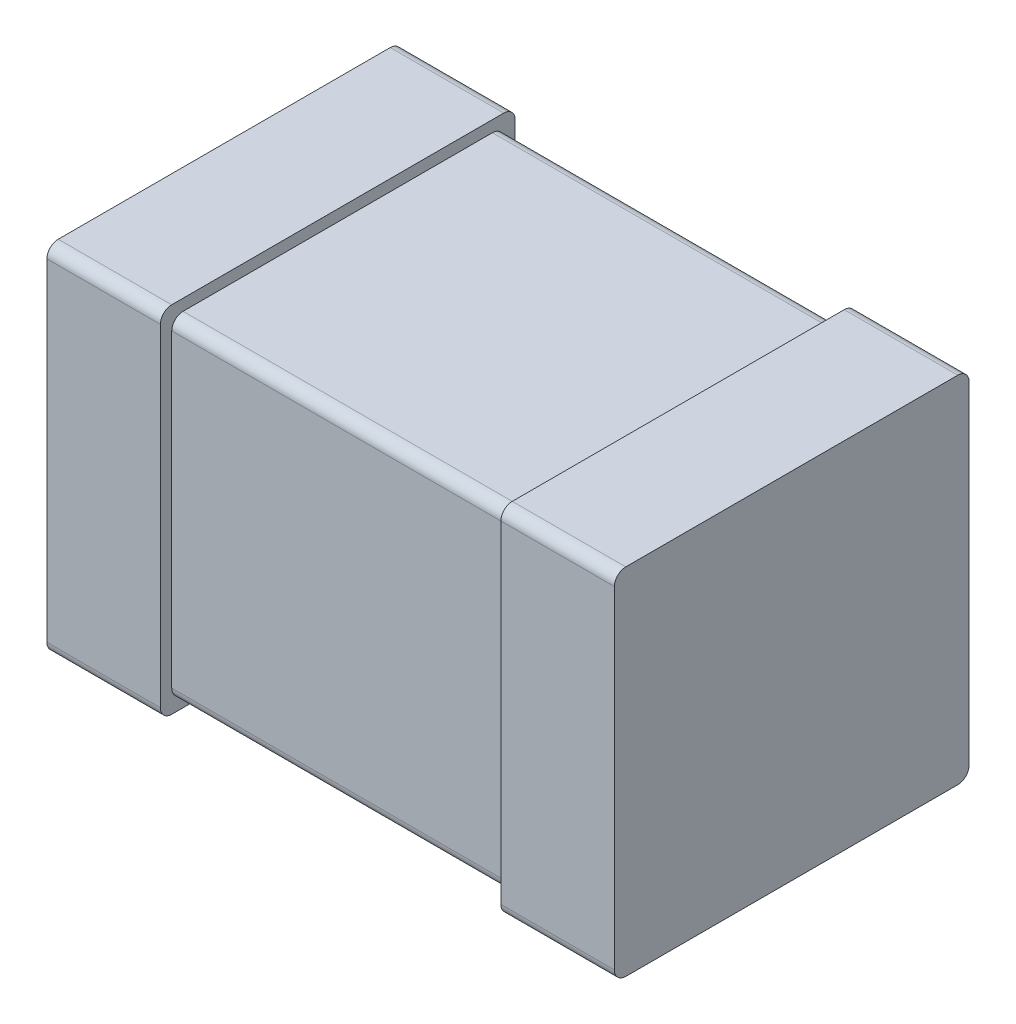
ISO-10303-21;
HEADER;
FILE_DESCRIPTION(('STEP AP214'),'2;1');
FILE_NAME('part.step','',(''),(''),'','','');
FILE_SCHEMA(('AUTOMOTIVE_DESIGN { 1 0 10303 214 1 1 1 1 }'));
ENDSEC;
DATA;
#1=APPLICATION_CONTEXT('core data for automotive mechanical design processes');
#2=APPLICATION_PROTOCOL_DEFINITION('international standard','automotive_design',2000,#1);
#3=PRODUCT_CONTEXT('',#1,'mechanical');
#4=PRODUCT('Part','Part','',(#3));
#5=PRODUCT_RELATED_PRODUCT_CATEGORY('part','',(#4));
#6=PRODUCT_DEFINITION_FORMATION('','',#4);
#7=PRODUCT_DEFINITION_CONTEXT('part definition',#1,'design');
#8=PRODUCT_DEFINITION('design','',#6,#7);
#9=PRODUCT_DEFINITION_SHAPE('','',#8);
#10=(LENGTH_UNIT() NAMED_UNIT(*) SI_UNIT(.MILLI.,.METRE.));
#11=(NAMED_UNIT(*) PLANE_ANGLE_UNIT() SI_UNIT($,.RADIAN.));
#12=(NAMED_UNIT(*) SI_UNIT($,.STERADIAN.) SOLID_ANGLE_UNIT());
#13=UNCERTAINTY_MEASURE_WITH_UNIT(LENGTH_MEASURE(1.E-05),#10,'distance_accuracy_value','');
#14=(GEOMETRIC_REPRESENTATION_CONTEXT(3) GLOBAL_UNCERTAINTY_ASSIGNED_CONTEXT((#13)) GLOBAL_UNIT_ASSIGNED_CONTEXT((#10,
#11,#12)) REPRESENTATION_CONTEXT('',''));
#15=CARTESIAN_POINT('',(0.,0.,0.));
#16=DIRECTION('',(0.,0.,1.));
#17=DIRECTION('',(1.,0.,0.));
#18=AXIS2_PLACEMENT_3D('',#15,#16,#17);
#19=CARTESIAN_POINT('',(-1.,-0.625,0.));
#20=DIRECTION('',(1.,0.,0.));
#21=DIRECTION('',(0.,1.,0.));
#22=AXIS2_PLACEMENT_3D('',#19,#20,#21);
#23=PLANE('',#22);
#24=CARTESIAN_POINT('',(-1.,-0.585,1.21));
#25=DIRECTION('',(-1.,0.,0.));
#26=DIRECTION('',(0.,0.,1.));
#27=AXIS2_PLACEMENT_3D('',#24,#25,#26);
#28=CIRCLE('',#27,0.04);
#29=CARTESIAN_POINT('',(-1.,-0.625,1.21));
#30=VERTEX_POINT('',#29);
#31=CARTESIAN_POINT('',(-1.,-0.585,1.25));
#32=VERTEX_POINT('',#31);
#33=EDGE_CURVE('E11',#30,#32,#28,.T.);
#34=ORIENTED_EDGE('',*,*,#33,.T.);
#35=DIRECTION('',(0.,1.,0.));
#36=VECTOR('',#35,1.);
#37=CARTESIAN_POINT('',(-1.,-0.625,1.25));
#38=LINE('',#37,#36);
#39=CARTESIAN_POINT('',(-1.,0.585,1.25));
#40=VERTEX_POINT('',#39);
#41=EDGE_CURVE('E27',#32,#40,#38,.T.);
#42=ORIENTED_EDGE('',*,*,#41,.T.);
#43=CARTESIAN_POINT('',(-1.,0.585,1.21));
#44=DIRECTION('',(1.,0.,0.));
#45=DIRECTION('',(0.,0.,1.));
#46=AXIS2_PLACEMENT_3D('',#43,#44,#45);
#47=CIRCLE('',#46,0.04);
#48=CARTESIAN_POINT('',(-1.,0.625,1.21));
#49=VERTEX_POINT('',#48);
#50=EDGE_CURVE('E466',#49,#40,#47,.T.);
#51=ORIENTED_EDGE('',*,*,#50,.F.);
#52=DIRECTION('',(0.,0.,1.));
#53=VECTOR('',#52,1.);
#54=CARTESIAN_POINT('',(-1.,0.625,0.));
#55=LINE('',#54,#53);
#56=CARTESIAN_POINT('',(-1.,0.625,0.04));
#57=VERTEX_POINT('',#56);
#58=EDGE_CURVE('E264',#57,#49,#55,.T.);
#59=ORIENTED_EDGE('',*,*,#58,.F.);
#60=CARTESIAN_POINT('',(-1.,0.585,0.04));
#61=DIRECTION('',(-1.,0.,0.));
#62=DIRECTION('',(0.,0.,1.));
#63=AXIS2_PLACEMENT_3D('',#60,#61,#62);
#64=CIRCLE('',#63,0.04);
#65=CARTESIAN_POINT('',(-1.,0.585,0.));
#66=VERTEX_POINT('',#65);
#67=EDGE_CURVE('E342',#57,#66,#64,.T.);
#68=ORIENTED_EDGE('',*,*,#67,.T.);
#69=DIRECTION('',(0.,1.,0.));
#70=VECTOR('',#69,1.);
#71=CARTESIAN_POINT('',(-1.,-0.625,0.));
#72=LINE('',#71,#70);
#73=CARTESIAN_POINT('',(-1.,-0.585,0.));
#74=VERTEX_POINT('',#73);
#75=EDGE_CURVE('E278',#74,#66,#72,.T.);
#76=ORIENTED_EDGE('',*,*,#75,.F.);
#77=CARTESIAN_POINT('',(-1.,-0.585,0.04));
#78=DIRECTION('',(1.,0.,0.));
#79=DIRECTION('',(0.,0.,1.));
#80=AXIS2_PLACEMENT_3D('',#77,#78,#79);
#81=CIRCLE('',#80,0.04);
#82=CARTESIAN_POINT('',(-1.,-0.625,0.04));
#83=VERTEX_POINT('',#82);
#84=EDGE_CURVE('E358',#83,#74,#81,.T.);
#85=ORIENTED_EDGE('',*,*,#84,.F.);
#86=DIRECTION('',(0.,0.,1.));
#87=VECTOR('',#86,1.);
#88=CARTESIAN_POINT('',(-1.,-0.625,0.));
#89=LINE('',#88,#87);
#90=EDGE_CURVE('E346',#83,#30,#89,.T.);
#91=ORIENTED_EDGE('',*,*,#90,.T.);
#92=EDGE_LOOP('',(#34,#42,#51,#59,#68,#76,#85,#91));
#93=FACE_BOUND('',#92,.T.);
#94=ADVANCED_FACE('F16',(#93),#23,.F.);
#95=CARTESIAN_POINT('',(-1.,-0.625,0.));
#96=DIRECTION('',(0.,1.,0.));
#97=DIRECTION('',(1.,0.,0.));
#98=AXIS2_PLACEMENT_3D('',#95,#96,#97);
#99=PLANE('',#98);
#100=DIRECTION('',(1.,0.,0.));
#101=VECTOR('',#100,1.);
#102=CARTESIAN_POINT('',(-1.,-0.625,1.21));
#103=LINE('',#102,#101);
#104=CARTESIAN_POINT('',(-0.6,-0.625,1.21));
#105=VERTEX_POINT('',#104);
#106=EDGE_CURVE('E336',#30,#105,#103,.T.);
#107=ORIENTED_EDGE('',*,*,#106,.F.);
#108=ORIENTED_EDGE('',*,*,#90,.F.);
#109=DIRECTION('',(1.,0.,0.));
#110=VECTOR('',#109,1.);
#111=CARTESIAN_POINT('',(-1.,-0.625,0.04));
#112=LINE('',#111,#110);
#113=CARTESIAN_POINT('',(-0.6,-0.625,0.04));
#114=VERTEX_POINT('',#113);
#115=EDGE_CURVE('E353',#83,#114,#112,.T.);
#116=ORIENTED_EDGE('',*,*,#115,.T.);
#117=DIRECTION('',(0.,0.,1.));
#118=VECTOR('',#117,1.);
#119=CARTESIAN_POINT('',(-0.6,-0.625,0.));
#120=LINE('',#119,#118);
#121=EDGE_CURVE('E354',#114,#105,#120,.T.);
#122=ORIENTED_EDGE('',*,*,#121,.T.);
#123=EDGE_LOOP('',(#107,#108,#116,#122));
#124=FACE_BOUND('',#123,.T.);
#125=ADVANCED_FACE('F572',(#124),#99,.F.);
#126=CARTESIAN_POINT('',(-1.,-0.585,0.04));
#127=DIRECTION('',(1.,0.,0.));
#128=DIRECTION('',(0.,-1.,0.));
#129=AXIS2_PLACEMENT_3D('',#126,#127,#128);
#130=CYLINDRICAL_SURFACE('',#129,0.04);
#131=ORIENTED_EDGE('',*,*,#84,.T.);
#132=DIRECTION('',(1.,0.,0.));
#133=VECTOR('',#132,1.);
#134=CARTESIAN_POINT('',(-1.,-0.585,0.));
#135=LINE('',#134,#133);
#136=CARTESIAN_POINT('',(-0.6,-0.585,0.));
#137=VERTEX_POINT('',#136);
#138=EDGE_CURVE('E435',#74,#137,#135,.T.);
#139=ORIENTED_EDGE('',*,*,#138,.T.);
#140=CARTESIAN_POINT('',(-0.6,-0.585,0.04));
#141=DIRECTION('',(1.,0.,0.));
#142=DIRECTION('',(0.,0.,1.));
#143=AXIS2_PLACEMENT_3D('',#140,#141,#142);
#144=CIRCLE('',#143,0.04);
#145=EDGE_CURVE('E288',#114,#137,#144,.T.);
#146=ORIENTED_EDGE('',*,*,#145,.F.);
#147=ORIENTED_EDGE('',*,*,#115,.F.);
#148=EDGE_LOOP('',(#131,#139,#146,#147));
#149=FACE_BOUND('',#148,.T.);
#150=ADVANCED_FACE('F579',(#149),#130,.T.);
#151=CARTESIAN_POINT('',(-1.,-0.585,1.21));
#152=DIRECTION('',(1.,0.,0.));
#153=DIRECTION('',(0.,-1.,0.));
#154=AXIS2_PLACEMENT_3D('',#151,#152,#153);
#155=CYLINDRICAL_SURFACE('',#154,0.04);
#156=ORIENTED_EDGE('',*,*,#106,.T.);
#157=CARTESIAN_POINT('',(-0.6,-0.585,1.21));
#158=DIRECTION('',(-1.,0.,0.));
#159=DIRECTION('',(0.,0.,1.));
#160=AXIS2_PLACEMENT_3D('',#157,#158,#159);
#161=CIRCLE('',#160,0.04);
#162=CARTESIAN_POINT('',(-0.6,-0.585,1.25));
#163=VERTEX_POINT('',#162);
#164=EDGE_CURVE('E332',#105,#163,#161,.T.);
#165=ORIENTED_EDGE('',*,*,#164,.T.);
#166=DIRECTION('',(1.,0.,0.));
#167=VECTOR('',#166,1.);
#168=CARTESIAN_POINT('',(-1.,-0.585,1.25));
#169=LINE('',#168,#167);
#170=EDGE_CURVE('E275',#32,#163,#169,.T.);
#171=ORIENTED_EDGE('',*,*,#170,.F.);
#172=ORIENTED_EDGE('',*,*,#33,.F.);
#173=EDGE_LOOP('',(#156,#165,#171,#172));
#174=FACE_BOUND('',#173,.T.);
#175=ADVANCED_FACE('F595',(#174),#155,.T.);
#176=CARTESIAN_POINT('',(-1.,-0.625,0.));
#177=DIRECTION('',(0.,0.,1.));
#178=DIRECTION('',(1.,0.,0.));
#179=AXIS2_PLACEMENT_3D('',#176,#177,#178);
#180=PLANE('',#179);
#181=DIRECTION('',(1.,0.,0.));
#182=VECTOR('',#181,1.);
#183=CARTESIAN_POINT('',(-1.,0.585,0.));
#184=LINE('',#183,#182);
#185=CARTESIAN_POINT('',(-0.6,0.585,0.));
#186=VERTEX_POINT('',#185);
#187=EDGE_CURVE('E337',#66,#186,#184,.T.);
#188=ORIENTED_EDGE('',*,*,#187,.T.);
#189=DIRECTION('',(0.,1.,0.));
#190=VECTOR('',#189,1.);
#191=CARTESIAN_POINT('',(-0.6,-0.625,0.));
#192=LINE('',#191,#190);
#193=EDGE_CURVE('E291',#137,#186,#192,.T.);
#194=ORIENTED_EDGE('',*,*,#193,.F.);
#195=ORIENTED_EDGE('',*,*,#138,.F.);
#196=ORIENTED_EDGE('',*,*,#75,.T.);
#197=EDGE_LOOP('',(#188,#194,#195,#196));
#198=FACE_BOUND('',#197,.T.);
#199=ADVANCED_FACE('F18',(#198),#180,.F.);
#200=CARTESIAN_POINT('',(-1.,-0.625,1.25));
#201=DIRECTION('',(0.,0.,1.));
#202=DIRECTION('',(1.,0.,0.));
#203=AXIS2_PLACEMENT_3D('',#200,#201,#202);
#204=PLANE('',#203);
#205=ORIENTED_EDGE('',*,*,#41,.F.);
#206=ORIENTED_EDGE('',*,*,#170,.T.);
#207=DIRECTION('',(0.,1.,0.));
#208=VECTOR('',#207,1.);
#209=CARTESIAN_POINT('',(-0.6,-0.625,1.25));
#210=LINE('',#209,#208);
#211=CARTESIAN_POINT('',(-0.6,0.585,1.25));
#212=VERTEX_POINT('',#211);
#213=EDGE_CURVE('E279',#163,#212,#210,.T.);
#214=ORIENTED_EDGE('',*,*,#213,.T.);
#215=DIRECTION('',(1.,0.,0.));
#216=VECTOR('',#215,1.);
#217=CARTESIAN_POINT('',(-1.,0.585,1.25));
#218=LINE('',#217,#216);
#219=EDGE_CURVE('E267',#40,#212,#218,.T.);
#220=ORIENTED_EDGE('',*,*,#219,.F.);
#221=EDGE_LOOP('',(#205,#206,#214,#220));
#222=FACE_BOUND('',#221,.T.);
#223=ADVANCED_FACE('F638',(#222),#204,.T.);
#224=CARTESIAN_POINT('',(-1.,0.585,0.04));
#225=DIRECTION('',(1.,0.,0.));
#226=DIRECTION('',(0.,1.,0.));
#227=AXIS2_PLACEMENT_3D('',#224,#225,#226);
#228=CYLINDRICAL_SURFACE('',#227,0.04);
#229=DIRECTION('',(1.,0.,0.));
#230=VECTOR('',#229,1.);
#231=CARTESIAN_POINT('',(-1.,0.625,0.04));
#232=LINE('',#231,#230);
#233=CARTESIAN_POINT('',(-0.6,0.625,0.04));
#234=VERTEX_POINT('',#233);
#235=EDGE_CURVE('E393',#57,#234,#232,.T.);
#236=ORIENTED_EDGE('',*,*,#235,.T.);
#237=CARTESIAN_POINT('',(-0.6,0.585,0.04));
#238=DIRECTION('',(-1.,0.,0.));
#239=DIRECTION('',(0.,0.,1.));
#240=AXIS2_PLACEMENT_3D('',#237,#238,#239);
#241=CIRCLE('',#240,0.04);
#242=EDGE_CURVE('E237',#234,#186,#241,.T.);
#243=ORIENTED_EDGE('',*,*,#242,.T.);
#244=ORIENTED_EDGE('',*,*,#187,.F.);
#245=ORIENTED_EDGE('',*,*,#67,.F.);
#246=EDGE_LOOP('',(#236,#243,#244,#245));
#247=FACE_BOUND('',#246,.T.);
#248=ADVANCED_FACE('F640',(#247),#228,.T.);
#249=CARTESIAN_POINT('',(-1.,0.585,1.21));
#250=DIRECTION('',(1.,0.,0.));
#251=DIRECTION('',(0.,1.,0.));
#252=AXIS2_PLACEMENT_3D('',#249,#250,#251);
#253=CYLINDRICAL_SURFACE('',#252,0.04);
#254=ORIENTED_EDGE('',*,*,#50,.T.);
#255=ORIENTED_EDGE('',*,*,#219,.T.);
#256=CARTESIAN_POINT('',(-0.6,0.585,1.21));
#257=DIRECTION('',(1.,0.,0.));
#258=DIRECTION('',(0.,0.,1.));
#259=AXIS2_PLACEMENT_3D('',#256,#257,#258);
#260=CIRCLE('',#259,0.04);
#261=CARTESIAN_POINT('',(-0.6,0.625,1.21));
#262=VERTEX_POINT('',#261);
#263=EDGE_CURVE('E269',#262,#212,#260,.T.);
#264=ORIENTED_EDGE('',*,*,#263,.F.);
#265=DIRECTION('',(1.,0.,0.));
#266=VECTOR('',#265,1.);
#267=CARTESIAN_POINT('',(-1.,0.625,1.21));
#268=LINE('',#267,#266);
#269=EDGE_CURVE('E268',#49,#262,#268,.T.);
#270=ORIENTED_EDGE('',*,*,#269,.F.);
#271=EDGE_LOOP('',(#254,#255,#264,#270));
#272=FACE_BOUND('',#271,.T.);
#273=ADVANCED_FACE('F627',(#272),#253,.T.);
#274=CARTESIAN_POINT('',(-1.,0.625,0.));
#275=DIRECTION('',(0.,1.,0.));
#276=DIRECTION('',(1.,0.,0.));
#277=AXIS2_PLACEMENT_3D('',#274,#275,#276);
#278=PLANE('',#277);
#279=DIRECTION('',(0.,0.,1.));
#280=VECTOR('',#279,1.);
#281=CARTESIAN_POINT('',(-0.6,0.625,0.));
#282=LINE('',#281,#280);
#283=EDGE_CURVE('E273',#234,#262,#282,.T.);
#284=ORIENTED_EDGE('',*,*,#283,.F.);
#285=ORIENTED_EDGE('',*,*,#235,.F.);
#286=ORIENTED_EDGE('',*,*,#58,.T.);
#287=ORIENTED_EDGE('',*,*,#269,.T.);
#288=EDGE_LOOP('',(#284,#285,#286,#287));
#289=FACE_BOUND('',#288,.T.);
#290=ADVANCED_FACE('F607',(#289),#278,.T.);
#291=CARTESIAN_POINT('',(-0.6,-0.625,0.));
#292=DIRECTION('',(1.,0.,0.));
#293=DIRECTION('',(0.,1.,0.));
#294=AXIS2_PLACEMENT_3D('',#291,#292,#293);
#295=PLANE('',#294);
#296=ORIENTED_EDGE('',*,*,#121,.F.);
#297=ORIENTED_EDGE('',*,*,#145,.T.);
#298=ORIENTED_EDGE('',*,*,#193,.T.);
#299=ORIENTED_EDGE('',*,*,#242,.F.);
#300=ORIENTED_EDGE('',*,*,#283,.T.);
#301=ORIENTED_EDGE('',*,*,#263,.T.);
#302=ORIENTED_EDGE('',*,*,#213,.F.);
#303=ORIENTED_EDGE('',*,*,#164,.F.);
#304=EDGE_LOOP('',(#296,#297,#298,#299,#300,#301,#302,#303));
#305=FACE_BOUND('',#304,.T.);
#306=CARTESIAN_POINT('',(-0.6,-0.545,0.08));
#307=DIRECTION('',(1.,0.,0.));
#308=DIRECTION('',(0.,0.,1.));
#309=AXIS2_PLACEMENT_3D('',#306,#307,#308);
#310=CIRCLE('',#309,0.04);
#311=CARTESIAN_POINT('',(-0.6,-0.585,0.08));
#312=VERTEX_POINT('',#311);
#313=CARTESIAN_POINT('',(-0.6,-0.545,0.04));
#314=VERTEX_POINT('',#313);
#315=EDGE_CURVE('E341',#312,#314,#310,.T.);
#316=ORIENTED_EDGE('',*,*,#315,.F.);
#317=DIRECTION('',(0.,0.,1.));
#318=VECTOR('',#317,1.);
#319=CARTESIAN_POINT('',(-0.6,-0.585,0.04));
#320=LINE('',#319,#318);
#321=CARTESIAN_POINT('',(-0.6,-0.585,1.17));
#322=VERTEX_POINT('',#321);
#323=EDGE_CURVE('E274',#312,#322,#320,.T.);
#324=ORIENTED_EDGE('',*,*,#323,.T.);
#325=CARTESIAN_POINT('',(-0.6,-0.545,1.17));
#326=DIRECTION('',(-1.,0.,0.));
#327=DIRECTION('',(0.,0.,1.));
#328=AXIS2_PLACEMENT_3D('',#325,#326,#327);
#329=CIRCLE('',#328,0.04);
#330=CARTESIAN_POINT('',(-0.6,-0.545,1.21));
#331=VERTEX_POINT('',#330);
#332=EDGE_CURVE('E416',#322,#331,#329,.T.);
#333=ORIENTED_EDGE('',*,*,#332,.T.);
#334=DIRECTION('',(0.,1.,0.));
#335=VECTOR('',#334,1.);
#336=CARTESIAN_POINT('',(-0.6,-0.585,1.21));
#337=LINE('',#336,#335);
#338=CARTESIAN_POINT('',(-0.6,0.545,1.21));
#339=VERTEX_POINT('',#338);
#340=EDGE_CURVE('E209',#331,#339,#337,.T.);
#341=ORIENTED_EDGE('',*,*,#340,.T.);
#342=CARTESIAN_POINT('',(-0.6,0.545,1.17));
#343=DIRECTION('',(1.,0.,0.));
#344=DIRECTION('',(0.,0.,1.));
#345=AXIS2_PLACEMENT_3D('',#342,#343,#344);
#346=CIRCLE('',#345,0.04);
#347=CARTESIAN_POINT('',(-0.6,0.585,1.17));
#348=VERTEX_POINT('',#347);
#349=EDGE_CURVE('E206',#348,#339,#346,.T.);
#350=ORIENTED_EDGE('',*,*,#349,.F.);
#351=DIRECTION('',(0.,0.,1.));
#352=VECTOR('',#351,1.);
#353=CARTESIAN_POINT('',(-0.6,0.585,0.04));
#354=LINE('',#353,#352);
#355=CARTESIAN_POINT('',(-0.6,0.585,0.08));
#356=VERTEX_POINT('',#355);
#357=EDGE_CURVE('E201',#356,#348,#354,.T.);
#358=ORIENTED_EDGE('',*,*,#357,.F.);
#359=CARTESIAN_POINT('',(-0.6,0.545,0.08));
#360=DIRECTION('',(-1.,0.,0.));
#361=DIRECTION('',(0.,0.,1.));
#362=AXIS2_PLACEMENT_3D('',#359,#360,#361);
#363=CIRCLE('',#362,0.04);
#364=CARTESIAN_POINT('',(-0.6,0.545,0.04));
#365=VERTEX_POINT('',#364);
#366=EDGE_CURVE('E338',#356,#365,#363,.T.);
#367=ORIENTED_EDGE('',*,*,#366,.T.);
#368=DIRECTION('',(0.,1.,0.));
#369=VECTOR('',#368,1.);
#370=CARTESIAN_POINT('',(-0.6,-0.585,0.04));
#371=LINE('',#370,#369);
#372=EDGE_CURVE('E359',#314,#365,#371,.T.);
#373=ORIENTED_EDGE('',*,*,#372,.F.);
#374=EDGE_LOOP('',(#316,#324,#333,#341,#350,#358,#367,#373));
#375=FACE_BOUND('',#374,.T.);
#376=ADVANCED_FACE('F207',(#305,#375),#295,.T.);
#377=CARTESIAN_POINT('',(-0.6,-0.545,0.08));
#378=DIRECTION('',(1.,0.,0.));
#379=DIRECTION('',(0.,-1.,0.));
#380=AXIS2_PLACEMENT_3D('',#377,#378,#379);
#381=CYLINDRICAL_SURFACE('',#380,0.04);
#382=ORIENTED_EDGE('',*,*,#315,.T.);
#383=DIRECTION('',(1.,0.,0.));
#384=VECTOR('',#383,1.);
#385=CARTESIAN_POINT('',(-0.6,-0.545,0.04));
#386=LINE('',#385,#384);
#387=CARTESIAN_POINT('',(0.6,-0.545,0.04));
#388=VERTEX_POINT('',#387);
#389=EDGE_CURVE('E394',#314,#388,#386,.T.);
#390=ORIENTED_EDGE('',*,*,#389,.T.);
#391=CARTESIAN_POINT('',(0.6,-0.545,0.08));
#392=DIRECTION('',(1.,0.,0.));
#393=DIRECTION('',(0.,0.,1.));
#394=AXIS2_PLACEMENT_3D('',#391,#392,#393);
#395=CIRCLE('',#394,0.04);
#396=CARTESIAN_POINT('',(0.6,-0.585,0.08));
#397=VERTEX_POINT('',#396);
#398=EDGE_CURVE('E262',#397,#388,#395,.T.);
#399=ORIENTED_EDGE('',*,*,#398,.F.);
#400=DIRECTION('',(1.,0.,0.));
#401=VECTOR('',#400,1.);
#402=CARTESIAN_POINT('',(-0.6,-0.585,0.08));
#403=LINE('',#402,#401);
#404=EDGE_CURVE('E299',#312,#397,#403,.T.);
#405=ORIENTED_EDGE('',*,*,#404,.F.);
#406=EDGE_LOOP('',(#382,#390,#399,#405));
#407=FACE_BOUND('',#406,.T.);
#408=ADVANCED_FACE('F603',(#407),#381,.T.);
#409=CARTESIAN_POINT('',(-0.6,-0.585,0.04));
#410=DIRECTION('',(0.,0.,1.));
#411=DIRECTION('',(1.,0.,0.));
#412=AXIS2_PLACEMENT_3D('',#409,#410,#411);
#413=PLANE('',#412);
#414=DIRECTION('',(1.,0.,0.));
#415=VECTOR('',#414,1.);
#416=CARTESIAN_POINT('',(-0.6,0.545,0.04));
#417=LINE('',#416,#415);
#418=CARTESIAN_POINT('',(0.6,0.545,0.04));
#419=VERTEX_POINT('',#418);
#420=EDGE_CURVE('E362',#365,#419,#417,.T.);
#421=ORIENTED_EDGE('',*,*,#420,.T.);
#422=DIRECTION('',(0.,1.,0.));
#423=VECTOR('',#422,1.);
#424=CARTESIAN_POINT('',(0.6,-0.585,0.04));
#425=LINE('',#424,#423);
#426=EDGE_CURVE('E294',#388,#419,#425,.T.);
#427=ORIENTED_EDGE('',*,*,#426,.F.);
#428=ORIENTED_EDGE('',*,*,#389,.F.);
#429=ORIENTED_EDGE('',*,*,#372,.T.);
#430=EDGE_LOOP('',(#421,#427,#428,#429));
#431=FACE_BOUND('',#430,.T.);
#432=ADVANCED_FACE('F599',(#431),#413,.F.);
#433=CARTESIAN_POINT('',(-0.6,0.545,0.08));
#434=DIRECTION('',(1.,0.,0.));
#435=DIRECTION('',(0.,1.,0.));
#436=AXIS2_PLACEMENT_3D('',#433,#434,#435);
#437=CYLINDRICAL_SURFACE('',#436,0.04);
#438=DIRECTION('',(1.,0.,0.));
#439=VECTOR('',#438,1.);
#440=CARTESIAN_POINT('',(-0.6,0.585,0.08));
#441=LINE('',#440,#439);
#442=CARTESIAN_POINT('',(0.6,0.585,0.08));
#443=VERTEX_POINT('',#442);
#444=EDGE_CURVE('E225',#356,#443,#441,.T.);
#445=ORIENTED_EDGE('',*,*,#444,.T.);
#446=CARTESIAN_POINT('',(0.6,0.545,0.08));
#447=DIRECTION('',(-1.,0.,0.));
#448=DIRECTION('',(0.,0.,1.));
#449=AXIS2_PLACEMENT_3D('',#446,#447,#448);
#450=CIRCLE('',#449,0.04);
#451=EDGE_CURVE('E227',#443,#419,#450,.T.);
#452=ORIENTED_EDGE('',*,*,#451,.T.);
#453=ORIENTED_EDGE('',*,*,#420,.F.);
#454=ORIENTED_EDGE('',*,*,#366,.F.);
#455=EDGE_LOOP('',(#445,#452,#453,#454));
#456=FACE_BOUND('',#455,.T.);
#457=ADVANCED_FACE('F602',(#456),#437,.T.);
#458=CARTESIAN_POINT('',(-0.6,0.585,0.04));
#459=DIRECTION('',(0.,1.,0.));
#460=DIRECTION('',(1.,0.,0.));
#461=AXIS2_PLACEMENT_3D('',#458,#459,#460);
#462=PLANE('',#461);
#463=DIRECTION('',(0.,0.,1.));
#464=VECTOR('',#463,1.);
#465=CARTESIAN_POINT('',(0.6,0.585,0.04));
#466=LINE('',#465,#464);
#467=CARTESIAN_POINT('',(0.6,0.585,1.17));
#468=VERTEX_POINT('',#467);
#469=EDGE_CURVE('E292',#443,#468,#466,.T.);
#470=ORIENTED_EDGE('',*,*,#469,.F.);
#471=ORIENTED_EDGE('',*,*,#444,.F.);
#472=ORIENTED_EDGE('',*,*,#357,.T.);
#473=DIRECTION('',(1.,0.,0.));
#474=VECTOR('',#473,1.);
#475=CARTESIAN_POINT('',(-0.6,0.585,1.17));
#476=LINE('',#475,#474);
#477=EDGE_CURVE('E215',#348,#468,#476,.T.);
#478=ORIENTED_EDGE('',*,*,#477,.T.);
#479=EDGE_LOOP('',(#470,#471,#472,#478));
#480=FACE_BOUND('',#479,.T.);
#481=ADVANCED_FACE('F222',(#480),#462,.T.);
#482=CARTESIAN_POINT('',(-0.6,0.545,1.17));
#483=DIRECTION('',(1.,0.,0.));
#484=DIRECTION('',(0.,1.,0.));
#485=AXIS2_PLACEMENT_3D('',#482,#483,#484);
#486=CYLINDRICAL_SURFACE('',#485,0.04);
#487=ORIENTED_EDGE('',*,*,#349,.T.);
#488=DIRECTION('',(1.,0.,0.));
#489=VECTOR('',#488,1.);
#490=CARTESIAN_POINT('',(-0.6,0.545,1.21));
#491=LINE('',#490,#489);
#492=CARTESIAN_POINT('',(0.6,0.545,1.21));
#493=VERTEX_POINT('',#492);
#494=EDGE_CURVE('E216',#339,#493,#491,.T.);
#495=ORIENTED_EDGE('',*,*,#494,.T.);
#496=CARTESIAN_POINT('',(0.6,0.545,1.17));
#497=DIRECTION('',(1.,0.,0.));
#498=DIRECTION('',(0.,0.,1.));
#499=AXIS2_PLACEMENT_3D('',#496,#497,#498);
#500=CIRCLE('',#499,0.04);
#501=EDGE_CURVE('E20',#468,#493,#500,.T.);
#502=ORIENTED_EDGE('',*,*,#501,.F.);
#503=ORIENTED_EDGE('',*,*,#477,.F.);
#504=EDGE_LOOP('',(#487,#495,#502,#503));
#505=FACE_BOUND('',#504,.T.);
#506=ADVANCED_FACE('F229',(#505),#486,.T.);
#507=CARTESIAN_POINT('',(-0.6,-0.585,1.21));
#508=DIRECTION('',(0.,0.,1.));
#509=DIRECTION('',(1.,0.,0.));
#510=AXIS2_PLACEMENT_3D('',#507,#508,#509);
#511=PLANE('',#510);
#512=ORIENTED_EDGE('',*,*,#340,.F.);
#513=DIRECTION('',(1.,0.,0.));
#514=VECTOR('',#513,1.);
#515=CARTESIAN_POINT('',(-0.6,-0.545,1.21));
#516=LINE('',#515,#514);
#517=CARTESIAN_POINT('',(0.6,-0.545,1.21));
#518=VERTEX_POINT('',#517);
#519=EDGE_CURVE('E249',#331,#518,#516,.T.);
#520=ORIENTED_EDGE('',*,*,#519,.T.);
#521=DIRECTION('',(0.,1.,0.));
#522=VECTOR('',#521,1.);
#523=CARTESIAN_POINT('',(0.6,-0.585,1.21));
#524=LINE('',#523,#522);
#525=EDGE_CURVE('E253',#518,#493,#524,.T.);
#526=ORIENTED_EDGE('',*,*,#525,.T.);
#527=ORIENTED_EDGE('',*,*,#494,.F.);
#528=EDGE_LOOP('',(#512,#520,#526,#527));
#529=FACE_BOUND('',#528,.T.);
#530=ADVANCED_FACE('F587',(#529),#511,.T.);
#531=CARTESIAN_POINT('',(-0.6,-0.545,1.17));
#532=DIRECTION('',(1.,0.,0.));
#533=DIRECTION('',(0.,-1.,0.));
#534=AXIS2_PLACEMENT_3D('',#531,#532,#533);
#535=CYLINDRICAL_SURFACE('',#534,0.04);
#536=DIRECTION('',(1.,0.,0.));
#537=VECTOR('',#536,1.);
#538=CARTESIAN_POINT('',(-0.6,-0.585,1.17));
#539=LINE('',#538,#537);
#540=CARTESIAN_POINT('',(0.6,-0.585,1.17));
#541=VERTEX_POINT('',#540);
#542=EDGE_CURVE('E298',#322,#541,#539,.T.);
#543=ORIENTED_EDGE('',*,*,#542,.T.);
#544=CARTESIAN_POINT('',(0.6,-0.545,1.17));
#545=DIRECTION('',(-1.,0.,0.));
#546=DIRECTION('',(0.,0.,1.));
#547=AXIS2_PLACEMENT_3D('',#544,#545,#546);
#548=CIRCLE('',#547,0.04);
#549=EDGE_CURVE('E295',#541,#518,#548,.T.);
#550=ORIENTED_EDGE('',*,*,#549,.T.);
#551=ORIENTED_EDGE('',*,*,#519,.F.);
#552=ORIENTED_EDGE('',*,*,#332,.F.);
#553=EDGE_LOOP('',(#543,#550,#551,#552));
#554=FACE_BOUND('',#553,.T.);
#555=ADVANCED_FACE('F590',(#554),#535,.T.);
#556=CARTESIAN_POINT('',(-0.6,-0.585,0.04));
#557=DIRECTION('',(0.,1.,0.));
#558=DIRECTION('',(1.,0.,0.));
#559=AXIS2_PLACEMENT_3D('',#556,#557,#558);
#560=PLANE('',#559);
#561=ORIENTED_EDGE('',*,*,#542,.F.);
#562=ORIENTED_EDGE('',*,*,#323,.F.);
#563=ORIENTED_EDGE('',*,*,#404,.T.);
#564=DIRECTION('',(0.,0.,1.));
#565=VECTOR('',#564,1.);
#566=CARTESIAN_POINT('',(0.6,-0.585,0.04));
#567=LINE('',#566,#565);
#568=EDGE_CURVE('E310',#397,#541,#567,.T.);
#569=ORIENTED_EDGE('',*,*,#568,.T.);
#570=EDGE_LOOP('',(#561,#562,#563,#569));
#571=FACE_BOUND('',#570,.T.);
#572=ADVANCED_FACE('F592',(#571),#560,.F.);
#573=CARTESIAN_POINT('',(0.6,-0.625,0.));
#574=DIRECTION('',(1.,0.,0.));
#575=DIRECTION('',(0.,1.,0.));
#576=AXIS2_PLACEMENT_3D('',#573,#574,#575);
#577=PLANE('',#576);
#578=CARTESIAN_POINT('',(0.6,-0.585,1.21));
#579=DIRECTION('',(-1.,0.,0.));
#580=DIRECTION('',(0.,0.,1.));
#581=AXIS2_PLACEMENT_3D('',#578,#579,#580);
#582=CIRCLE('',#581,0.04);
#583=CARTESIAN_POINT('',(0.6,-0.625,1.21));
#584=VERTEX_POINT('',#583);
#585=CARTESIAN_POINT('',(0.6,-0.585,1.25));
#586=VERTEX_POINT('',#585);
#587=EDGE_CURVE('E321',#584,#586,#582,.T.);
#588=ORIENTED_EDGE('',*,*,#587,.T.);
#589=DIRECTION('',(0.,1.,0.));
#590=VECTOR('',#589,1.);
#591=CARTESIAN_POINT('',(0.6,-0.625,1.25));
#592=LINE('',#591,#590);
#593=CARTESIAN_POINT('',(0.6,0.585,1.25));
#594=VERTEX_POINT('',#593);
#595=EDGE_CURVE('E374',#586,#594,#592,.T.);
#596=ORIENTED_EDGE('',*,*,#595,.T.);
#597=CARTESIAN_POINT('',(0.6,0.585,1.21));
#598=DIRECTION('',(1.,0.,0.));
#599=DIRECTION('',(0.,0.,1.));
#600=AXIS2_PLACEMENT_3D('',#597,#598,#599);
#601=CIRCLE('',#600,0.04);
#602=CARTESIAN_POINT('',(0.6,0.625,1.21));
#603=VERTEX_POINT('',#602);
#604=EDGE_CURVE('E427',#603,#594,#601,.T.);
#605=ORIENTED_EDGE('',*,*,#604,.F.);
#606=DIRECTION('',(0.,0.,1.));
#607=VECTOR('',#606,1.);
#608=CARTESIAN_POINT('',(0.6,0.625,0.));
#609=LINE('',#608,#607);
#610=CARTESIAN_POINT('',(0.6,0.625,0.04));
#611=VERTEX_POINT('',#610);
#612=EDGE_CURVE('E405',#611,#603,#609,.T.);
#613=ORIENTED_EDGE('',*,*,#612,.F.);
#614=CARTESIAN_POINT('',(0.6,0.585,0.04));
#615=DIRECTION('',(-1.,0.,0.));
#616=DIRECTION('',(0.,0.,1.));
#617=AXIS2_PLACEMENT_3D('',#614,#615,#616);
#618=CIRCLE('',#617,0.04);
#619=CARTESIAN_POINT('',(0.6,0.585,0.));
#620=VERTEX_POINT('',#619);
#621=EDGE_CURVE('E370',#611,#620,#618,.T.);
#622=ORIENTED_EDGE('',*,*,#621,.T.);
#623=DIRECTION('',(0.,1.,0.));
#624=VECTOR('',#623,1.);
#625=CARTESIAN_POINT('',(0.6,-0.625,0.));
#626=LINE('',#625,#624);
#627=CARTESIAN_POINT('',(0.6,-0.585,0.));
#628=VERTEX_POINT('',#627);
#629=EDGE_CURVE('E242',#628,#620,#626,.T.);
#630=ORIENTED_EDGE('',*,*,#629,.F.);
#631=CARTESIAN_POINT('',(0.6,-0.585,0.04));
#632=DIRECTION('',(1.,0.,0.));
#633=DIRECTION('',(0.,0.,1.));
#634=AXIS2_PLACEMENT_3D('',#631,#632,#633);
#635=CIRCLE('',#634,0.04);
#636=CARTESIAN_POINT('',(0.6,-0.625,0.04));
#637=VERTEX_POINT('',#636);
#638=EDGE_CURVE('E329',#637,#628,#635,.T.);
#639=ORIENTED_EDGE('',*,*,#638,.F.);
#640=DIRECTION('',(0.,0.,1.));
#641=VECTOR('',#640,1.);
#642=CARTESIAN_POINT('',(0.6,-0.625,0.));
#643=LINE('',#642,#641);
#644=EDGE_CURVE('E375',#637,#584,#643,.T.);
#645=ORIENTED_EDGE('',*,*,#644,.T.);
#646=EDGE_LOOP('',(#588,#596,#605,#613,#622,#630,#639,#645));
#647=FACE_BOUND('',#646,.T.);
#648=ORIENTED_EDGE('',*,*,#426,.T.);
#649=ORIENTED_EDGE('',*,*,#451,.F.);
#650=ORIENTED_EDGE('',*,*,#469,.T.);
#651=ORIENTED_EDGE('',*,*,#501,.T.);
#652=ORIENTED_EDGE('',*,*,#525,.F.);
#653=ORIENTED_EDGE('',*,*,#549,.F.);
#654=ORIENTED_EDGE('',*,*,#568,.F.);
#655=ORIENTED_EDGE('',*,*,#398,.T.);
#656=EDGE_LOOP('',(#648,#649,#650,#651,#652,#653,#654,#655));
#657=FACE_BOUND('',#656,.T.);
#658=ADVANCED_FACE('F507',(#647,#657),#577,.F.);
#659=CARTESIAN_POINT('',(0.6,-0.625,0.));
#660=DIRECTION('',(0.,1.,0.));
#661=DIRECTION('',(1.,0.,0.));
#662=AXIS2_PLACEMENT_3D('',#659,#660,#661);
#663=PLANE('',#662);
#664=DIRECTION('',(1.,0.,0.));
#665=VECTOR('',#664,1.);
#666=CARTESIAN_POINT('',(0.6,-0.625,1.21));
#667=LINE('',#666,#665);
#668=CARTESIAN_POINT('',(1.,-0.625,1.21));
#669=VERTEX_POINT('',#668);
#670=EDGE_CURVE('E350',#584,#669,#667,.T.);
#671=ORIENTED_EDGE('',*,*,#670,.F.);
#672=ORIENTED_EDGE('',*,*,#644,.F.);
#673=DIRECTION('',(1.,0.,0.));
#674=VECTOR('',#673,1.);
#675=CARTESIAN_POINT('',(0.6,-0.625,0.04));
#676=LINE('',#675,#674);
#677=CARTESIAN_POINT('',(1.,-0.625,0.04));
#678=VERTEX_POINT('',#677);
#679=EDGE_CURVE('E258',#637,#678,#676,.T.);
#680=ORIENTED_EDGE('',*,*,#679,.T.);
#681=DIRECTION('',(0.,0.,1.));
#682=VECTOR('',#681,1.);
#683=CARTESIAN_POINT('',(1.,-0.625,0.));
#684=LINE('',#683,#682);
#685=EDGE_CURVE('E263',#678,#669,#684,.T.);
#686=ORIENTED_EDGE('',*,*,#685,.T.);
#687=EDGE_LOOP('',(#671,#672,#680,#686));
#688=FACE_BOUND('',#687,.T.);
#689=ADVANCED_FACE('F527',(#688),#663,.F.);
#690=CARTESIAN_POINT('',(0.6,-0.585,0.04));
#691=DIRECTION('',(1.,0.,0.));
#692=DIRECTION('',(0.,-1.,0.));
#693=AXIS2_PLACEMENT_3D('',#690,#691,#692);
#694=CYLINDRICAL_SURFACE('',#693,0.04);
#695=ORIENTED_EDGE('',*,*,#638,.T.);
#696=DIRECTION('',(1.,0.,0.));
#697=VECTOR('',#696,1.);
#698=CARTESIAN_POINT('',(0.6,-0.585,0.));
#699=LINE('',#698,#697);
#700=CARTESIAN_POINT('',(1.,-0.585,0.));
#701=VERTEX_POINT('',#700);
#702=EDGE_CURVE('E382',#628,#701,#699,.T.);
#703=ORIENTED_EDGE('',*,*,#702,.T.);
#704=CARTESIAN_POINT('',(1.,-0.585,0.04));
#705=DIRECTION('',(1.,0.,0.));
#706=DIRECTION('',(0.,0.,1.));
#707=AXIS2_PLACEMENT_3D('',#704,#705,#706);
#708=CIRCLE('',#707,0.04);
#709=EDGE_CURVE('E247',#678,#701,#708,.T.);
#710=ORIENTED_EDGE('',*,*,#709,.F.);
#711=ORIENTED_EDGE('',*,*,#679,.F.);
#712=EDGE_LOOP('',(#695,#703,#710,#711));
#713=FACE_BOUND('',#712,.T.);
#714=ADVANCED_FACE('F520',(#713),#694,.T.);
#715=CARTESIAN_POINT('',(0.6,-0.585,1.21));
#716=DIRECTION('',(1.,0.,0.));
#717=DIRECTION('',(0.,-1.,0.));
#718=AXIS2_PLACEMENT_3D('',#715,#716,#717);
#719=CYLINDRICAL_SURFACE('',#718,0.04);
#720=ORIENTED_EDGE('',*,*,#670,.T.);
#721=CARTESIAN_POINT('',(1.,-0.585,1.21));
#722=DIRECTION('',(-1.,0.,0.));
#723=DIRECTION('',(0.,0.,1.));
#724=AXIS2_PLACEMENT_3D('',#721,#722,#723);
#725=CIRCLE('',#724,0.04);
#726=CARTESIAN_POINT('',(1.,-0.585,1.25));
#727=VERTEX_POINT('',#726);
#728=EDGE_CURVE('E287',#669,#727,#725,.T.);
#729=ORIENTED_EDGE('',*,*,#728,.T.);
#730=DIRECTION('',(1.,0.,0.));
#731=VECTOR('',#730,1.);
#732=CARTESIAN_POINT('',(0.6,-0.585,1.25));
#733=LINE('',#732,#731);
#734=EDGE_CURVE('E239',#586,#727,#733,.T.);
#735=ORIENTED_EDGE('',*,*,#734,.F.);
#736=ORIENTED_EDGE('',*,*,#587,.F.);
#737=EDGE_LOOP('',(#720,#729,#735,#736));
#738=FACE_BOUND('',#737,.T.);
#739=ADVANCED_FACE('F531',(#738),#719,.T.);
#740=CARTESIAN_POINT('',(0.6,-0.625,0.));
#741=DIRECTION('',(0.,0.,1.));
#742=DIRECTION('',(1.,0.,0.));
#743=AXIS2_PLACEMENT_3D('',#740,#741,#742);
#744=PLANE('',#743);
#745=DIRECTION('',(1.,0.,0.));
#746=VECTOR('',#745,1.);
#747=CARTESIAN_POINT('',(0.6,0.585,0.));
#748=LINE('',#747,#746);
#749=CARTESIAN_POINT('',(1.,0.585,0.));
#750=VERTEX_POINT('',#749);
#751=EDGE_CURVE('E283',#620,#750,#748,.T.);
#752=ORIENTED_EDGE('',*,*,#751,.T.);
#753=DIRECTION('',(0.,1.,0.));
#754=VECTOR('',#753,1.);
#755=CARTESIAN_POINT('',(1.,-0.625,0.));
#756=LINE('',#755,#754);
#757=EDGE_CURVE('E244',#701,#750,#756,.T.);
#758=ORIENTED_EDGE('',*,*,#757,.F.);
#759=ORIENTED_EDGE('',*,*,#702,.F.);
#760=ORIENTED_EDGE('',*,*,#629,.T.);
#761=EDGE_LOOP('',(#752,#758,#759,#760));
#762=FACE_BOUND('',#761,.T.);
#763=ADVANCED_FACE('F501',(#762),#744,.F.);
#764=CARTESIAN_POINT('',(0.6,-0.625,1.25));
#765=DIRECTION('',(0.,0.,1.));
#766=DIRECTION('',(1.,0.,0.));
#767=AXIS2_PLACEMENT_3D('',#764,#765,#766);
#768=PLANE('',#767);
#769=ORIENTED_EDGE('',*,*,#595,.F.);
#770=ORIENTED_EDGE('',*,*,#734,.T.);
#771=DIRECTION('',(0.,1.,0.));
#772=VECTOR('',#771,1.);
#773=CARTESIAN_POINT('',(1.,-0.625,1.25));
#774=LINE('',#773,#772);
#775=CARTESIAN_POINT('',(1.,0.585,1.25));
#776=VERTEX_POINT('',#775);
#777=EDGE_CURVE('E243',#727,#776,#774,.T.);
#778=ORIENTED_EDGE('',*,*,#777,.T.);
#779=DIRECTION('',(1.,0.,0.));
#780=VECTOR('',#779,1.);
#781=CARTESIAN_POINT('',(0.6,0.585,1.25));
#782=LINE('',#781,#780);
#783=EDGE_CURVE('E409',#594,#776,#782,.T.);
#784=ORIENTED_EDGE('',*,*,#783,.F.);
#785=EDGE_LOOP('',(#769,#770,#778,#784));
#786=FACE_BOUND('',#785,.T.);
#787=ADVANCED_FACE('F560',(#786),#768,.T.);
#788=CARTESIAN_POINT('',(0.6,0.585,0.04));
#789=DIRECTION('',(1.,0.,0.));
#790=DIRECTION('',(0.,1.,0.));
#791=AXIS2_PLACEMENT_3D('',#788,#789,#790);
#792=CYLINDRICAL_SURFACE('',#791,0.04);
#793=DIRECTION('',(1.,0.,0.));
#794=VECTOR('',#793,1.);
#795=CARTESIAN_POINT('',(0.6,0.625,0.04));
#796=LINE('',#795,#794);
#797=CARTESIAN_POINT('',(1.,0.625,0.04));
#798=VERTEX_POINT('',#797);
#799=EDGE_CURVE('E257',#611,#798,#796,.T.);
#800=ORIENTED_EDGE('',*,*,#799,.T.);
#801=CARTESIAN_POINT('',(1.,0.585,0.04));
#802=DIRECTION('',(-1.,0.,0.));
#803=DIRECTION('',(0.,0.,1.));
#804=AXIS2_PLACEMENT_3D('',#801,#802,#803);
#805=CIRCLE('',#804,0.04);
#806=EDGE_CURVE('E455',#798,#750,#805,.T.);
#807=ORIENTED_EDGE('',*,*,#806,.T.);
#808=ORIENTED_EDGE('',*,*,#751,.F.);
#809=ORIENTED_EDGE('',*,*,#621,.F.);
#810=EDGE_LOOP('',(#800,#807,#808,#809));
#811=FACE_BOUND('',#810,.T.);
#812=ADVANCED_FACE('F512',(#811),#792,.T.);
#813=CARTESIAN_POINT('',(0.6,0.585,1.21));
#814=DIRECTION('',(1.,0.,0.));
#815=DIRECTION('',(0.,1.,0.));
#816=AXIS2_PLACEMENT_3D('',#813,#814,#815);
#817=CYLINDRICAL_SURFACE('',#816,0.04);
#818=ORIENTED_EDGE('',*,*,#604,.T.);
#819=ORIENTED_EDGE('',*,*,#783,.T.);
#820=CARTESIAN_POINT('',(1.,0.585,1.21));
#821=DIRECTION('',(1.,0.,0.));
#822=DIRECTION('',(0.,0.,1.));
#823=AXIS2_PLACEMENT_3D('',#820,#821,#822);
#824=CIRCLE('',#823,0.04);
#825=CARTESIAN_POINT('',(1.,0.625,1.21));
#826=VERTEX_POINT('',#825);
#827=EDGE_CURVE('E366',#826,#776,#824,.T.);
#828=ORIENTED_EDGE('',*,*,#827,.F.);
#829=DIRECTION('',(1.,0.,0.));
#830=VECTOR('',#829,1.);
#831=CARTESIAN_POINT('',(0.6,0.625,1.21));
#832=LINE('',#831,#830);
#833=EDGE_CURVE('E325',#603,#826,#832,.T.);
#834=ORIENTED_EDGE('',*,*,#833,.F.);
#835=EDGE_LOOP('',(#818,#819,#828,#834));
#836=FACE_BOUND('',#835,.T.);
#837=ADVANCED_FACE('F556',(#836),#817,.T.);
#838=CARTESIAN_POINT('',(0.6,0.625,0.));
#839=DIRECTION('',(0.,1.,0.));
#840=DIRECTION('',(1.,0.,0.));
#841=AXIS2_PLACEMENT_3D('',#838,#839,#840);
#842=PLANE('',#841);
#843=DIRECTION('',(0.,0.,1.));
#844=VECTOR('',#843,1.);
#845=CARTESIAN_POINT('',(1.,0.625,0.));
#846=LINE('',#845,#844);
#847=EDGE_CURVE('E248',#798,#826,#846,.T.);
#848=ORIENTED_EDGE('',*,*,#847,.F.);
#849=ORIENTED_EDGE('',*,*,#799,.F.);
#850=ORIENTED_EDGE('',*,*,#612,.T.);
#851=ORIENTED_EDGE('',*,*,#833,.T.);
#852=EDGE_LOOP('',(#848,#849,#850,#851));
#853=FACE_BOUND('',#852,.T.);
#854=ADVANCED_FACE('F553',(#853),#842,.T.);
#855=CARTESIAN_POINT('',(1.,-0.625,0.));
#856=DIRECTION('',(1.,0.,0.));
#857=DIRECTION('',(0.,1.,0.));
#858=AXIS2_PLACEMENT_3D('',#855,#856,#857);
#859=PLANE('',#858);
#860=ORIENTED_EDGE('',*,*,#685,.F.);
#861=ORIENTED_EDGE('',*,*,#709,.T.);
#862=ORIENTED_EDGE('',*,*,#757,.T.);
#863=ORIENTED_EDGE('',*,*,#806,.F.);
#864=ORIENTED_EDGE('',*,*,#847,.T.);
#865=ORIENTED_EDGE('',*,*,#827,.T.);
#866=ORIENTED_EDGE('',*,*,#777,.F.);
#867=ORIENTED_EDGE('',*,*,#728,.F.);
#868=EDGE_LOOP('',(#860,#861,#862,#863,#864,#865,#866,#867));
#869=FACE_BOUND('',#868,.T.);
#870=ADVANCED_FACE('F515',(#869),#859,.T.);
#871=CLOSED_SHELL('',(#94,#125,#150,#175,#199,#223,#248,#273,#290,#376,#408,#432,#457,#481,#506,
#530,#555,#572,#658,#689,#714,#739,#763,#787,#812,#837,#854,#870));
#872=MANIFOLD_SOLID_BREP('B1',#871);
#873=ADVANCED_BREP_SHAPE_REPRESENTATION('',(#18,#872),#14);
#874=SHAPE_DEFINITION_REPRESENTATION(#9,#873);
ENDSEC;
END-ISO-10303-21;
